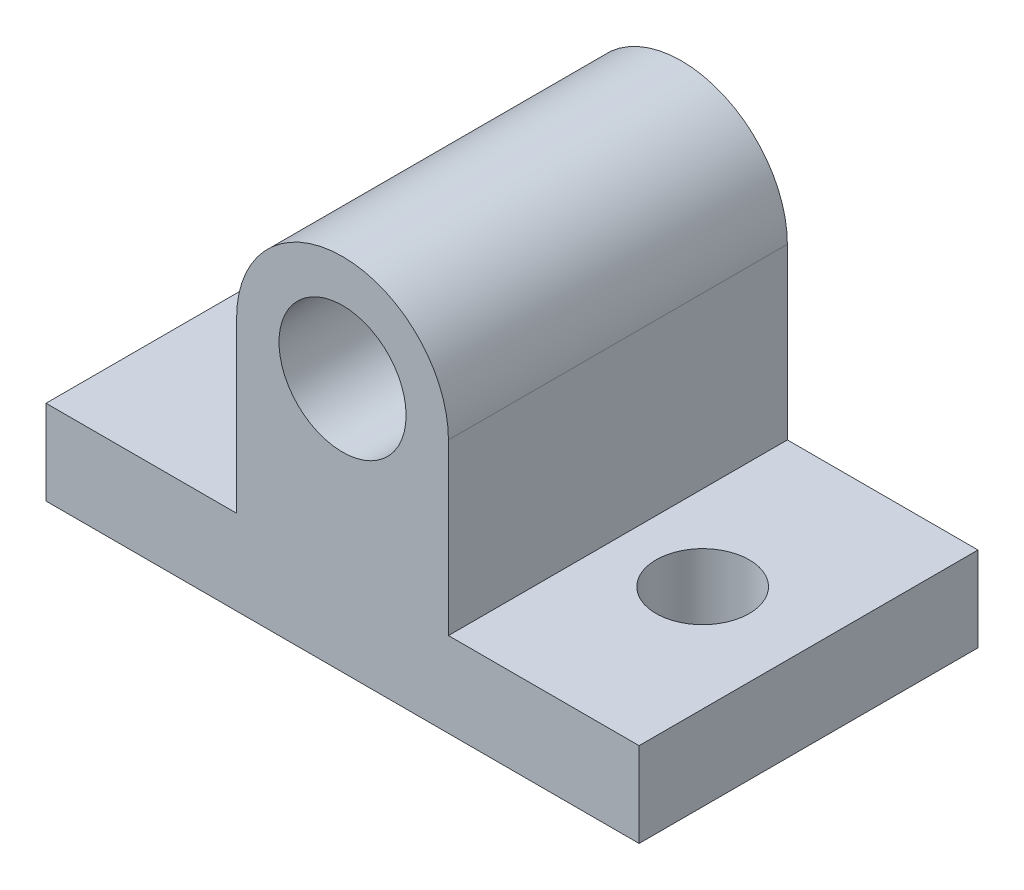
ISO-10303-21;
HEADER;
FILE_DESCRIPTION(('STEP AP214'),'2;1');
FILE_NAME('part.step','',(''),(''),'','','');
FILE_SCHEMA(('AUTOMOTIVE_DESIGN { 1 0 10303 214 1 1 1 1 }'));
ENDSEC;
DATA;
#1=APPLICATION_CONTEXT('core data for automotive mechanical design processes');
#2=APPLICATION_PROTOCOL_DEFINITION('international standard','automotive_design',2000,#1);
#3=PRODUCT_CONTEXT('',#1,'mechanical');
#4=PRODUCT('Part','Part','',(#3));
#5=PRODUCT_RELATED_PRODUCT_CATEGORY('part','',(#4));
#6=PRODUCT_DEFINITION_FORMATION('','',#4);
#7=PRODUCT_DEFINITION_CONTEXT('part definition',#1,'design');
#8=PRODUCT_DEFINITION('design','',#6,#7);
#9=PRODUCT_DEFINITION_SHAPE('','',#8);
#10=(LENGTH_UNIT() NAMED_UNIT(*) SI_UNIT(.MILLI.,.METRE.));
#11=(NAMED_UNIT(*) PLANE_ANGLE_UNIT() SI_UNIT($,.RADIAN.));
#12=(NAMED_UNIT(*) SI_UNIT($,.STERADIAN.) SOLID_ANGLE_UNIT());
#13=UNCERTAINTY_MEASURE_WITH_UNIT(LENGTH_MEASURE(1.E-05),#10,'distance_accuracy_value','');
#14=(GEOMETRIC_REPRESENTATION_CONTEXT(3) GLOBAL_UNCERTAINTY_ASSIGNED_CONTEXT((#13)) GLOBAL_UNIT_ASSIGNED_CONTEXT((#10,
#11,#12)) REPRESENTATION_CONTEXT('',''));
#15=CARTESIAN_POINT('',(0.,0.,0.));
#16=DIRECTION('',(0.,0.,1.));
#17=DIRECTION('',(1.,0.,0.));
#18=AXIS2_PLACEMENT_3D('',#15,#16,#17);
#19=CARTESIAN_POINT('',(0.,0.,0.));
#20=DIRECTION('',(0.,-1.,0.));
#21=DIRECTION('',(0.,0.,-1.));
#22=AXIS2_PLACEMENT_3D('',#19,#20,#21);
#23=CYLINDRICAL_SURFACE('',#22,1.49999999999999);
#24=CARTESIAN_POINT('',(0.,6.,0.));
#25=DIRECTION('',(0.,0.707106781186547,0.707106781186547));
#26=DIRECTION('',(0.,-0.707106781186547,0.707106781186547));
#27=AXIS2_PLACEMENT_3D('',#24,#25,#26);
#28=ELLIPSE('',#27,2.12132034355964,1.5);
#29=CARTESIAN_POINT('',(1.5,6.,0.));
#30=VERTEX_POINT('',#29);
#31=CARTESIAN_POINT('',(-1.5,6.,0.));
#32=VERTEX_POINT('',#31);
#33=EDGE_CURVE('E47',#30,#32,#28,.F.);
#34=ORIENTED_EDGE('',*,*,#33,.F.);
#35=CARTESIAN_POINT('',(0.,6.,0.));
#36=DIRECTION('',(0.,-0.707106781186547,0.707106781186547));
#37=DIRECTION('',(0.,0.707106781186547,0.707106781186547));
#38=AXIS2_PLACEMENT_3D('',#35,#36,#37);
#39=ELLIPSE('',#38,2.12132034355964,1.5);
#40=EDGE_CURVE('E11',#32,#30,#39,.T.);
#41=ORIENTED_EDGE('',*,*,#40,.F.);
#42=EDGE_LOOP('',(#34,#41));
#43=FACE_BOUND('',#42,.T.);
#44=CARTESIAN_POINT('',(0.,0.7,0.));
#45=DIRECTION('',(0.,-1.,0.));
#46=DIRECTION('',(0.,0.,-1.));
#47=AXIS2_PLACEMENT_3D('',#44,#45,#46);
#48=CIRCLE('',#47,1.49999999999999);
#49=CARTESIAN_POINT('',(0.,0.7,-1.49999999999999));
#50=VERTEX_POINT('',#49);
#51=EDGE_CURVE('E42',#50,#50,#48,.F.);
#52=ORIENTED_EDGE('',*,*,#51,.F.);
#53=EDGE_LOOP('',(#52));
#54=FACE_BOUND('',#53,.T.);
#55=ADVANCED_FACE('F38',(#43,#54),#23,.F.);
#56=CARTESIAN_POINT('',(0.,2.,0.));
#57=DIRECTION('',(0.,-1.,0.));
#58=DIRECTION('',(0.,0.,-1.));
#59=AXIS2_PLACEMENT_3D('',#56,#57,#58);
#60=PLANE('',#59);
#61=CARTESIAN_POINT('',(4.5,2.,0.));
#62=DIRECTION('',(0.,-1.,0.));
#63=DIRECTION('',(0.,0.,-1.));
#64=AXIS2_PLACEMENT_3D('',#61,#62,#63);
#65=CIRCLE('',#64,1.1);
#66=CARTESIAN_POINT('',(4.5,2.,-1.1));
#67=VERTEX_POINT('',#66);
#68=EDGE_CURVE('E124',#67,#67,#65,.T.);
#69=ORIENTED_EDGE('',*,*,#68,.T.);
#70=EDGE_LOOP('',(#69));
#71=FACE_BOUND('',#70,.T.);
#72=DIRECTION('',(0.,0.,-1.));
#73=VECTOR('',#72,1.);
#74=CARTESIAN_POINT('',(2.5,2.,12.2006097334284));
#75=LINE('',#74,#73);
#76=CARTESIAN_POINT('',(2.5,2.,4.));
#77=VERTEX_POINT('',#76);
#78=CARTESIAN_POINT('',(2.5,2.,-4.));
#79=VERTEX_POINT('',#78);
#80=EDGE_CURVE('E147',#77,#79,#75,.T.);
#81=ORIENTED_EDGE('',*,*,#80,.F.);
#82=DIRECTION('',(1.,0.,0.));
#83=VECTOR('',#82,1.);
#84=CARTESIAN_POINT('',(-7.,2.,4.));
#85=LINE('',#84,#83);
#86=CARTESIAN_POINT('',(7.,2.,4.));
#87=VERTEX_POINT('',#86);
#88=EDGE_CURVE('E164',#77,#87,#85,.T.);
#89=ORIENTED_EDGE('',*,*,#88,.T.);
#90=DIRECTION('',(0.,0.,-1.));
#91=VECTOR('',#90,1.);
#92=CARTESIAN_POINT('',(7.,2.,4.));
#93=LINE('',#92,#91);
#94=CARTESIAN_POINT('',(7.,2.,-4.));
#95=VERTEX_POINT('',#94);
#96=EDGE_CURVE('E154',#87,#95,#93,.T.);
#97=ORIENTED_EDGE('',*,*,#96,.T.);
#98=DIRECTION('',(-1.,0.,0.));
#99=VECTOR('',#98,1.);
#100=CARTESIAN_POINT('',(-7.,2.,-4.));
#101=LINE('',#100,#99);
#102=EDGE_CURVE('E159',#95,#79,#101,.T.);
#103=ORIENTED_EDGE('',*,*,#102,.T.);
#104=EDGE_LOOP('',(#81,#89,#97,#103));
#105=FACE_BOUND('',#104,.T.);
#106=ADVANCED_FACE('F218',(#71,#105),#60,.F.);
#107=CARTESIAN_POINT('',(7.,2.,4.));
#108=DIRECTION('',(-1.,0.,0.));
#109=DIRECTION('',(0.,0.,1.));
#110=AXIS2_PLACEMENT_3D('',#107,#108,#109);
#111=PLANE('',#110);
#112=DIRECTION('',(0.,0.,-1.));
#113=VECTOR('',#112,1.);
#114=CARTESIAN_POINT('',(7.,0.,4.));
#115=LINE('',#114,#113);
#116=CARTESIAN_POINT('',(7.,0.,4.));
#117=VERTEX_POINT('',#116);
#118=CARTESIAN_POINT('',(7.,0.,-4.));
#119=VERTEX_POINT('',#118);
#120=EDGE_CURVE('E145',#117,#119,#115,.T.);
#121=ORIENTED_EDGE('',*,*,#120,.T.);
#122=DIRECTION('',(0.,-1.,0.));
#123=VECTOR('',#122,1.);
#124=CARTESIAN_POINT('',(7.,2.,-4.));
#125=LINE('',#124,#123);
#126=EDGE_CURVE('E108',#95,#119,#125,.T.);
#127=ORIENTED_EDGE('',*,*,#126,.F.);
#128=ORIENTED_EDGE('',*,*,#96,.F.);
#129=DIRECTION('',(0.,-1.,0.));
#130=VECTOR('',#129,1.);
#131=CARTESIAN_POINT('',(7.,2.,4.));
#132=LINE('',#131,#130);
#133=EDGE_CURVE('E168',#87,#117,#132,.T.);
#134=ORIENTED_EDGE('',*,*,#133,.T.);
#135=EDGE_LOOP('',(#121,#127,#128,#134));
#136=FACE_BOUND('',#135,.T.);
#137=ADVANCED_FACE('F40',(#136),#111,.F.);
#138=CARTESIAN_POINT('',(-7.,2.,-4.));
#139=DIRECTION('',(0.,0.,1.));
#140=DIRECTION('',(1.,0.,0.));
#141=AXIS2_PLACEMENT_3D('',#138,#139,#140);
#142=PLANE('',#141);
#143=CARTESIAN_POINT('',(0.,6.,-4.));
#144=DIRECTION('',(0.,0.,1.));
#145=DIRECTION('',(1.,0.,0.));
#146=AXIS2_PLACEMENT_3D('',#143,#144,#145);
#147=CIRCLE('',#146,1.5);
#148=CARTESIAN_POINT('',(1.5,6.,-4.));
#149=VERTEX_POINT('',#148);
#150=EDGE_CURVE('E119',#149,#149,#147,.T.);
#151=ORIENTED_EDGE('',*,*,#150,.T.);
#152=EDGE_LOOP('',(#151));
#153=FACE_BOUND('',#152,.T.);
#154=DIRECTION('',(-1.,0.,0.));
#155=VECTOR('',#154,1.);
#156=CARTESIAN_POINT('',(-7.,0.,-4.));
#157=LINE('',#156,#155);
#158=CARTESIAN_POINT('',(-7.,0.,-4.));
#159=VERTEX_POINT('',#158);
#160=EDGE_CURVE('E171',#119,#159,#157,.T.);
#161=ORIENTED_EDGE('',*,*,#160,.T.);
#162=DIRECTION('',(0.,-1.,0.));
#163=VECTOR('',#162,1.);
#164=CARTESIAN_POINT('',(-7.,2.,-4.));
#165=LINE('',#164,#163);
#166=CARTESIAN_POINT('',(-7.,2.,-4.));
#167=VERTEX_POINT('',#166);
#168=EDGE_CURVE('E181',#167,#159,#165,.T.);
#169=ORIENTED_EDGE('',*,*,#168,.F.);
#170=CARTESIAN_POINT('',(-2.5,2.,-4.));
#171=VERTEX_POINT('',#170);
#172=EDGE_CURVE('E157',#171,#167,#101,.T.);
#173=ORIENTED_EDGE('',*,*,#172,.F.);
#174=DIRECTION('',(0.,-1.,0.));
#175=VECTOR('',#174,1.);
#176=CARTESIAN_POINT('',(-2.5,0.,-4.));
#177=LINE('',#176,#175);
#178=CARTESIAN_POINT('',(-2.5,6.,-4.));
#179=VERTEX_POINT('',#178);
#180=EDGE_CURVE('E59',#179,#171,#177,.T.);
#181=ORIENTED_EDGE('',*,*,#180,.F.);
#182=CARTESIAN_POINT('',(0.,6.,-4.));
#183=DIRECTION('',(0.,0.,1.));
#184=DIRECTION('',(1.,0.,0.));
#185=AXIS2_PLACEMENT_3D('',#182,#183,#184);
#186=CIRCLE('',#185,2.5);
#187=CARTESIAN_POINT('',(2.5,6.,-4.));
#188=VERTEX_POINT('',#187);
#189=EDGE_CURVE('E135',#188,#179,#186,.T.);
#190=ORIENTED_EDGE('',*,*,#189,.F.);
#191=DIRECTION('',(0.,-1.,0.));
#192=VECTOR('',#191,1.);
#193=CARTESIAN_POINT('',(2.5,0.,-4.));
#194=LINE('',#193,#192);
#195=EDGE_CURVE('E132',#188,#79,#194,.T.);
#196=ORIENTED_EDGE('',*,*,#195,.T.);
#197=ORIENTED_EDGE('',*,*,#102,.F.);
#198=ORIENTED_EDGE('',*,*,#126,.T.);
#199=EDGE_LOOP('',(#161,#169,#173,#181,#190,#196,#197,#198));
#200=FACE_BOUND('',#199,.T.);
#201=ADVANCED_FACE('F187',(#153,#200),#142,.F.);
#202=CARTESIAN_POINT('',(-7.,2.,4.));
#203=DIRECTION('',(1.,0.,0.));
#204=DIRECTION('',(0.,0.,-1.));
#205=AXIS2_PLACEMENT_3D('',#202,#203,#204);
#206=PLANE('',#205);
#207=DIRECTION('',(0.,0.,1.));
#208=VECTOR('',#207,1.);
#209=CARTESIAN_POINT('',(-7.,0.,4.));
#210=LINE('',#209,#208);
#211=CARTESIAN_POINT('',(-7.,0.,4.));
#212=VERTEX_POINT('',#211);
#213=EDGE_CURVE('E173',#159,#212,#210,.T.);
#214=ORIENTED_EDGE('',*,*,#213,.T.);
#215=DIRECTION('',(0.,-1.,0.));
#216=VECTOR('',#215,1.);
#217=CARTESIAN_POINT('',(-7.,2.,4.));
#218=LINE('',#217,#216);
#219=CARTESIAN_POINT('',(-7.,2.,4.));
#220=VERTEX_POINT('',#219);
#221=EDGE_CURVE('E178',#220,#212,#218,.T.);
#222=ORIENTED_EDGE('',*,*,#221,.F.);
#223=DIRECTION('',(0.,0.,1.));
#224=VECTOR('',#223,1.);
#225=CARTESIAN_POINT('',(-7.,2.,4.));
#226=LINE('',#225,#224);
#227=EDGE_CURVE('E162',#167,#220,#226,.T.);
#228=ORIENTED_EDGE('',*,*,#227,.F.);
#229=ORIENTED_EDGE('',*,*,#168,.T.);
#230=EDGE_LOOP('',(#214,#222,#228,#229));
#231=FACE_BOUND('',#230,.T.);
#232=ADVANCED_FACE('F199',(#231),#206,.F.);
#233=CARTESIAN_POINT('',(-7.,2.,4.));
#234=DIRECTION('',(0.,0.,-1.));
#235=DIRECTION('',(-1.,0.,0.));
#236=AXIS2_PLACEMENT_3D('',#233,#234,#235);
#237=PLANE('',#236);
#238=CARTESIAN_POINT('',(0.,6.,4.));
#239=DIRECTION('',(0.,0.,1.));
#240=DIRECTION('',(1.,0.,0.));
#241=AXIS2_PLACEMENT_3D('',#238,#239,#240);
#242=CIRCLE('',#241,1.5);
#243=CARTESIAN_POINT('',(1.5,6.,4.));
#244=VERTEX_POINT('',#243);
#245=EDGE_CURVE('E122',#244,#244,#242,.T.);
#246=ORIENTED_EDGE('',*,*,#245,.F.);
#247=EDGE_LOOP('',(#246));
#248=FACE_BOUND('',#247,.T.);
#249=DIRECTION('',(1.,0.,0.));
#250=VECTOR('',#249,1.);
#251=CARTESIAN_POINT('',(-7.,0.,4.));
#252=LINE('',#251,#250);
#253=EDGE_CURVE('E158',#212,#117,#252,.T.);
#254=ORIENTED_EDGE('',*,*,#253,.T.);
#255=ORIENTED_EDGE('',*,*,#133,.F.);
#256=ORIENTED_EDGE('',*,*,#88,.F.);
#257=DIRECTION('',(0.,-1.,0.));
#258=VECTOR('',#257,1.);
#259=CARTESIAN_POINT('',(2.5,0.,4.));
#260=LINE('',#259,#258);
#261=CARTESIAN_POINT('',(2.5,6.,4.));
#262=VERTEX_POINT('',#261);
#263=EDGE_CURVE('E143',#262,#77,#260,.T.);
#264=ORIENTED_EDGE('',*,*,#263,.F.);
#265=CARTESIAN_POINT('',(0.,6.,4.));
#266=DIRECTION('',(0.,0.,-1.));
#267=DIRECTION('',(-1.,0.,0.));
#268=AXIS2_PLACEMENT_3D('',#265,#266,#267);
#269=CIRCLE('',#268,2.5);
#270=CARTESIAN_POINT('',(-2.5,6.,4.));
#271=VERTEX_POINT('',#270);
#272=EDGE_CURVE('E142',#262,#271,#269,.F.);
#273=ORIENTED_EDGE('',*,*,#272,.T.);
#274=DIRECTION('',(0.,-1.,0.));
#275=VECTOR('',#274,1.);
#276=CARTESIAN_POINT('',(-2.5,0.,4.));
#277=LINE('',#276,#275);
#278=CARTESIAN_POINT('',(-2.5,2.,4.));
#279=VERTEX_POINT('',#278);
#280=EDGE_CURVE('E140',#271,#279,#277,.T.);
#281=ORIENTED_EDGE('',*,*,#280,.T.);
#282=EDGE_CURVE('E165',#220,#279,#85,.T.);
#283=ORIENTED_EDGE('',*,*,#282,.F.);
#284=ORIENTED_EDGE('',*,*,#221,.T.);
#285=EDGE_LOOP('',(#254,#255,#256,#264,#273,#281,#283,#284));
#286=FACE_BOUND('',#285,.T.);
#287=ADVANCED_FACE('F203',(#248,#286),#237,.F.);
#288=CARTESIAN_POINT('',(-4.5,2.,0.));
#289=DIRECTION('',(0.,-1.,0.));
#290=DIRECTION('',(0.,0.,-1.));
#291=AXIS2_PLACEMENT_3D('',#288,#289,#290);
#292=CIRCLE('',#291,1.1);
#293=CARTESIAN_POINT('',(-4.5,2.,-1.1));
#294=VERTEX_POINT('',#293);
#295=EDGE_CURVE('E240',#294,#294,#292,.T.);
#296=ORIENTED_EDGE('',*,*,#295,.T.);
#297=EDGE_LOOP('',(#296));
#298=FACE_BOUND('',#297,.T.);
#299=ORIENTED_EDGE('',*,*,#282,.T.);
#300=DIRECTION('',(0.,0.,-1.));
#301=VECTOR('',#300,1.);
#302=CARTESIAN_POINT('',(-2.5,2.,12.2006097334284));
#303=LINE('',#302,#301);
#304=EDGE_CURVE('E149',#279,#171,#303,.T.);
#305=ORIENTED_EDGE('',*,*,#304,.T.);
#306=ORIENTED_EDGE('',*,*,#172,.T.);
#307=ORIENTED_EDGE('',*,*,#227,.T.);
#308=EDGE_LOOP('',(#299,#305,#306,#307));
#309=FACE_BOUND('',#308,.T.);
#310=ADVANCED_FACE('F206',(#298,#309),#60,.F.);
#311=CARTESIAN_POINT('',(0.,0.,0.));
#312=DIRECTION('',(0.,-1.,0.));
#313=DIRECTION('',(0.,0.,-1.));
#314=AXIS2_PLACEMENT_3D('',#311,#312,#313);
#315=PLANE('',#314);
#316=CARTESIAN_POINT('',(0.,0.,0.));
#317=DIRECTION('',(0.,-1.,0.));
#318=DIRECTION('',(0.,0.,-1.));
#319=AXIS2_PLACEMENT_3D('',#316,#317,#318);
#320=CIRCLE('',#319,2.5);
#321=CARTESIAN_POINT('',(0.,0.,-2.5));
#322=VERTEX_POINT('',#321);
#323=EDGE_CURVE('E248',#322,#322,#320,.T.);
#324=ORIENTED_EDGE('',*,*,#323,.F.);
#325=EDGE_LOOP('',(#324));
#326=FACE_BOUND('',#325,.T.);
#327=CARTESIAN_POINT('',(-4.5,0.,0.));
#328=DIRECTION('',(0.,-1.,0.));
#329=DIRECTION('',(0.,0.,-1.));
#330=AXIS2_PLACEMENT_3D('',#327,#328,#329);
#331=CIRCLE('',#330,1.1);
#332=CARTESIAN_POINT('',(-4.5,0.,-1.1));
#333=VERTEX_POINT('',#332);
#334=EDGE_CURVE('E242',#333,#333,#331,.T.);
#335=ORIENTED_EDGE('',*,*,#334,.F.);
#336=EDGE_LOOP('',(#335));
#337=FACE_BOUND('',#336,.T.);
#338=CARTESIAN_POINT('',(4.5,0.,0.));
#339=DIRECTION('',(0.,-1.,0.));
#340=DIRECTION('',(0.,0.,-1.));
#341=AXIS2_PLACEMENT_3D('',#338,#339,#340);
#342=CIRCLE('',#341,1.1);
#343=CARTESIAN_POINT('',(4.5,0.,-1.1));
#344=VERTEX_POINT('',#343);
#345=EDGE_CURVE('E128',#344,#344,#342,.T.);
#346=ORIENTED_EDGE('',*,*,#345,.F.);
#347=EDGE_LOOP('',(#346));
#348=FACE_BOUND('',#347,.T.);
#349=ORIENTED_EDGE('',*,*,#120,.F.);
#350=ORIENTED_EDGE('',*,*,#253,.F.);
#351=ORIENTED_EDGE('',*,*,#213,.F.);
#352=ORIENTED_EDGE('',*,*,#160,.F.);
#353=EDGE_LOOP('',(#349,#350,#351,#352));
#354=FACE_BOUND('',#353,.T.);
#355=ADVANCED_FACE('F195',(#326,#337,#348,#354),#315,.T.);
#356=CARTESIAN_POINT('',(2.5,0.,12.2006097334284));
#357=DIRECTION('',(-1.,0.,0.));
#358=DIRECTION('',(0.,0.,1.));
#359=AXIS2_PLACEMENT_3D('',#356,#357,#358);
#360=PLANE('',#359);
#361=DIRECTION('',(0.,0.,-1.));
#362=VECTOR('',#361,1.);
#363=CARTESIAN_POINT('',(2.5,6.,12.2006097334284));
#364=LINE('',#363,#362);
#365=EDGE_CURVE('E138',#262,#188,#364,.T.);
#366=ORIENTED_EDGE('',*,*,#365,.F.);
#367=ORIENTED_EDGE('',*,*,#263,.T.);
#368=ORIENTED_EDGE('',*,*,#80,.T.);
#369=ORIENTED_EDGE('',*,*,#195,.F.);
#370=EDGE_LOOP('',(#366,#367,#368,#369));
#371=FACE_BOUND('',#370,.T.);
#372=ADVANCED_FACE('F215',(#371),#360,.F.);
#373=CARTESIAN_POINT('',(-2.5,0.,12.2006097334284));
#374=DIRECTION('',(-1.,0.,0.));
#375=DIRECTION('',(0.,0.,1.));
#376=AXIS2_PLACEMENT_3D('',#373,#374,#375);
#377=PLANE('',#376);
#378=ORIENTED_EDGE('',*,*,#280,.F.);
#379=DIRECTION('',(0.,0.,-1.));
#380=VECTOR('',#379,1.);
#381=CARTESIAN_POINT('',(-2.5,6.,12.2006097334284));
#382=LINE('',#381,#380);
#383=EDGE_CURVE('E151',#271,#179,#382,.T.);
#384=ORIENTED_EDGE('',*,*,#383,.T.);
#385=ORIENTED_EDGE('',*,*,#180,.T.);
#386=ORIENTED_EDGE('',*,*,#304,.F.);
#387=EDGE_LOOP('',(#378,#384,#385,#386));
#388=FACE_BOUND('',#387,.T.);
#389=ADVANCED_FACE('F277',(#388),#377,.T.);
#390=CARTESIAN_POINT('',(0.,6.,12.2006097334284));
#391=DIRECTION('',(0.,0.,-1.));
#392=DIRECTION('',(-1.,0.,0.));
#393=AXIS2_PLACEMENT_3D('',#390,#391,#392);
#394=CYLINDRICAL_SURFACE('',#393,2.5);
#395=ORIENTED_EDGE('',*,*,#272,.F.);
#396=ORIENTED_EDGE('',*,*,#365,.T.);
#397=ORIENTED_EDGE('',*,*,#189,.T.);
#398=ORIENTED_EDGE('',*,*,#383,.F.);
#399=EDGE_LOOP('',(#395,#396,#397,#398));
#400=FACE_BOUND('',#399,.T.);
#401=ADVANCED_FACE('F114',(#400),#394,.T.);
#402=CARTESIAN_POINT('',(0.,6.,4.));
#403=DIRECTION('',(0.,0.,1.));
#404=DIRECTION('',(1.,0.,0.));
#405=AXIS2_PLACEMENT_3D('',#402,#403,#404);
#406=CYLINDRICAL_SURFACE('',#405,1.5);
#407=ORIENTED_EDGE('',*,*,#33,.T.);
#408=ORIENTED_EDGE('',*,*,#40,.T.);
#409=EDGE_LOOP('',(#407,#408));
#410=FACE_BOUND('',#409,.T.);
#411=ORIENTED_EDGE('',*,*,#150,.F.);
#412=EDGE_LOOP('',(#411));
#413=FACE_BOUND('',#412,.T.);
#414=ORIENTED_EDGE('',*,*,#245,.T.);
#415=EDGE_LOOP('',(#414));
#416=FACE_BOUND('',#415,.T.);
#417=ADVANCED_FACE('F110',(#410,#413,#416),#406,.F.);
#418=CARTESIAN_POINT('',(4.5,0.,0.));
#419=DIRECTION('',(0.,-1.,0.));
#420=DIRECTION('',(0.,0.,-1.));
#421=AXIS2_PLACEMENT_3D('',#418,#419,#420);
#422=CYLINDRICAL_SURFACE('',#421,1.1);
#423=ORIENTED_EDGE('',*,*,#345,.T.);
#424=EDGE_LOOP('',(#423));
#425=FACE_BOUND('',#424,.T.);
#426=ORIENTED_EDGE('',*,*,#68,.F.);
#427=EDGE_LOOP('',(#426));
#428=FACE_BOUND('',#427,.T.);
#429=ADVANCED_FACE('F113',(#425,#428),#422,.F.);
#430=CARTESIAN_POINT('',(-4.5,0.,0.));
#431=DIRECTION('',(0.,-1.,0.));
#432=DIRECTION('',(0.,0.,-1.));
#433=AXIS2_PLACEMENT_3D('',#430,#431,#432);
#434=CYLINDRICAL_SURFACE('',#433,1.1);
#435=ORIENTED_EDGE('',*,*,#334,.T.);
#436=EDGE_LOOP('',(#435));
#437=FACE_BOUND('',#436,.T.);
#438=ORIENTED_EDGE('',*,*,#295,.F.);
#439=EDGE_LOOP('',(#438));
#440=FACE_BOUND('',#439,.T.);
#441=ADVANCED_FACE('F261',(#437,#440),#434,.F.);
#442=CARTESIAN_POINT('',(0.,0.7,0.));
#443=DIRECTION('',(0.,-1.,0.));
#444=DIRECTION('',(0.,0.,-1.));
#445=AXIS2_PLACEMENT_3D('',#442,#443,#444);
#446=PLANE('',#445);
#447=CARTESIAN_POINT('',(0.,0.7,0.));
#448=DIRECTION('',(0.,-1.,0.));
#449=DIRECTION('',(0.,0.,-1.));
#450=AXIS2_PLACEMENT_3D('',#447,#448,#449);
#451=CIRCLE('',#450,2.5);
#452=CARTESIAN_POINT('',(0.,0.7,-2.5));
#453=VERTEX_POINT('',#452);
#454=EDGE_CURVE('E251',#453,#453,#451,.T.);
#455=ORIENTED_EDGE('',*,*,#454,.T.);
#456=EDGE_LOOP('',(#455));
#457=FACE_BOUND('',#456,.T.);
#458=ORIENTED_EDGE('',*,*,#51,.T.);
#459=EDGE_LOOP('',(#458));
#460=FACE_BOUND('',#459,.T.);
#461=ADVANCED_FACE('F258',(#457,#460),#446,.T.);
#462=CARTESIAN_POINT('',(0.,0.7,0.));
#463=DIRECTION('',(0.,-1.,0.));
#464=DIRECTION('',(0.,0.,-1.));
#465=AXIS2_PLACEMENT_3D('',#462,#463,#464);
#466=CYLINDRICAL_SURFACE('',#465,2.5);
#467=ORIENTED_EDGE('',*,*,#454,.F.);
#468=EDGE_LOOP('',(#467));
#469=FACE_BOUND('',#468,.T.);
#470=ORIENTED_EDGE('',*,*,#323,.T.);
#471=EDGE_LOOP('',(#470));
#472=FACE_BOUND('',#471,.T.);
#473=ADVANCED_FACE('F260',(#469,#472),#466,.F.);
#474=CLOSED_SHELL('',(#55,#106,#137,#201,#232,#287,#310,#355,#372,#389,#401,#417,#429,#441,#461,#473));
#475=MANIFOLD_SOLID_BREP('B2',#474);
#476=ADVANCED_BREP_SHAPE_REPRESENTATION('',(#18,#475),#14);
#477=SHAPE_DEFINITION_REPRESENTATION(#9,#476);
ENDSEC;
END-ISO-10303-21;
